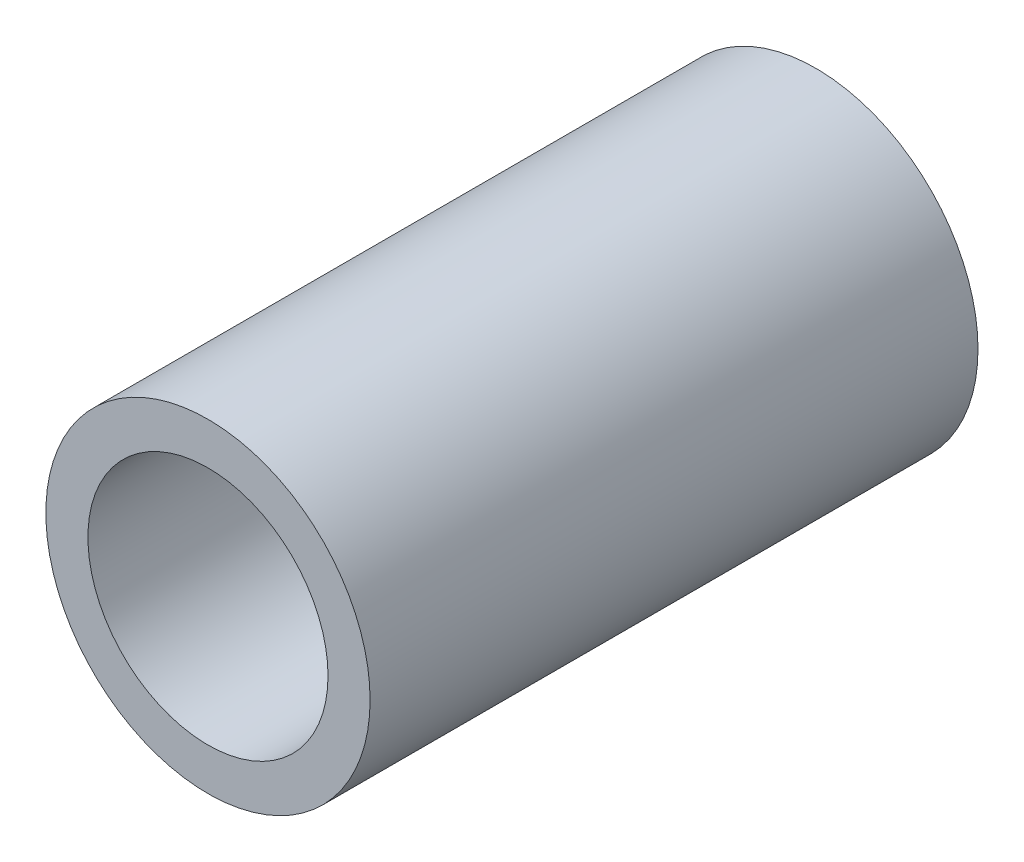
ISO-10303-21;
HEADER;
FILE_DESCRIPTION(('STEP AP214'),'2;1');
FILE_NAME('part.step','',(''),(''),'','','');
FILE_SCHEMA(('AUTOMOTIVE_DESIGN { 1 0 10303 214 1 1 1 1 }'));
ENDSEC;
DATA;
#1=APPLICATION_CONTEXT('core data for automotive mechanical design processes');
#2=APPLICATION_PROTOCOL_DEFINITION('international standard','automotive_design',2000,#1);
#3=PRODUCT_CONTEXT('',#1,'mechanical');
#4=PRODUCT('Part','Part','',(#3));
#5=PRODUCT_RELATED_PRODUCT_CATEGORY('part','',(#4));
#6=PRODUCT_DEFINITION_FORMATION('','',#4);
#7=PRODUCT_DEFINITION_CONTEXT('part definition',#1,'design');
#8=PRODUCT_DEFINITION('design','',#6,#7);
#9=PRODUCT_DEFINITION_SHAPE('','',#8);
#10=(LENGTH_UNIT() NAMED_UNIT(*) SI_UNIT(.MILLI.,.METRE.));
#11=(NAMED_UNIT(*) PLANE_ANGLE_UNIT() SI_UNIT($,.RADIAN.));
#12=(NAMED_UNIT(*) SI_UNIT($,.STERADIAN.) SOLID_ANGLE_UNIT());
#13=UNCERTAINTY_MEASURE_WITH_UNIT(LENGTH_MEASURE(1.E-05),#10,'distance_accuracy_value','');
#14=(GEOMETRIC_REPRESENTATION_CONTEXT(3) GLOBAL_UNCERTAINTY_ASSIGNED_CONTEXT((#13)) GLOBAL_UNIT_ASSIGNED_CONTEXT((#10,
#11,#12)) REPRESENTATION_CONTEXT('',''));
#15=CARTESIAN_POINT('',(0.,0.,0.));
#16=DIRECTION('',(0.,0.,1.));
#17=DIRECTION('',(1.,0.,0.));
#18=AXIS2_PLACEMENT_3D('',#15,#16,#17);
#19=CARTESIAN_POINT('',(0.,0.,20.));
#20=DIRECTION('',(0.,0.,1.));
#21=DIRECTION('',(1.,0.,0.));
#22=AXIS2_PLACEMENT_3D('',#19,#20,#21);
#23=PLANE('',#22);
#24=CARTESIAN_POINT('',(0.,0.,20.));
#25=DIRECTION('',(0.,0.,1.));
#26=DIRECTION('',(1.,0.,0.));
#27=AXIS2_PLACEMENT_3D('',#24,#25,#26);
#28=CIRCLE('',#27,10.668);
#29=CARTESIAN_POINT('',(10.668,0.,20.));
#30=VERTEX_POINT('',#29);
#31=EDGE_CURVE('E11',#30,#30,#28,.T.);
#32=ORIENTED_EDGE('',*,*,#31,.T.);
#33=EDGE_LOOP('',(#32));
#34=FACE_BOUND('',#33,.T.);
#35=CARTESIAN_POINT('',(0.,0.,20.));
#36=DIRECTION('',(0.,0.,1.));
#37=DIRECTION('',(1.,0.,0.));
#38=AXIS2_PLACEMENT_3D('',#35,#36,#37);
#39=CIRCLE('',#38,7.8994);
#40=CARTESIAN_POINT('',(7.8994,0.,20.));
#41=VERTEX_POINT('',#40);
#42=EDGE_CURVE('E48',#41,#41,#39,.T.);
#43=ORIENTED_EDGE('',*,*,#42,.F.);
#44=EDGE_LOOP('',(#43));
#45=FACE_BOUND('',#44,.T.);
#46=ADVANCED_FACE('F37',(#34,#45),#23,.T.);
#47=CARTESIAN_POINT('',(0.,0.,-20.));
#48=DIRECTION('',(0.,0.,1.));
#49=DIRECTION('',(1.,0.,0.));
#50=AXIS2_PLACEMENT_3D('',#47,#48,#49);
#51=PLANE('',#50);
#52=CARTESIAN_POINT('',(0.,0.,-20.));
#53=DIRECTION('',(0.,0.,1.));
#54=DIRECTION('',(1.,0.,0.));
#55=AXIS2_PLACEMENT_3D('',#52,#53,#54);
#56=CIRCLE('',#55,10.668);
#57=CARTESIAN_POINT('',(10.668,0.,-20.));
#58=VERTEX_POINT('',#57);
#59=EDGE_CURVE('E41',#58,#58,#56,.T.);
#60=ORIENTED_EDGE('',*,*,#59,.F.);
#61=EDGE_LOOP('',(#60));
#62=FACE_BOUND('',#61,.T.);
#63=CARTESIAN_POINT('',(0.,0.,-20.));
#64=DIRECTION('',(0.,0.,1.));
#65=DIRECTION('',(1.,0.,0.));
#66=AXIS2_PLACEMENT_3D('',#63,#64,#65);
#67=CIRCLE('',#66,7.8994);
#68=CARTESIAN_POINT('',(7.8994,0.,-20.));
#69=VERTEX_POINT('',#68);
#70=EDGE_CURVE('E50',#69,#69,#67,.T.);
#71=ORIENTED_EDGE('',*,*,#70,.T.);
#72=EDGE_LOOP('',(#71));
#73=FACE_BOUND('',#72,.T.);
#74=ADVANCED_FACE('F60',(#62,#73),#51,.F.);
#75=CARTESIAN_POINT('',(0.,0.,20.));
#76=DIRECTION('',(0.,0.,-1.));
#77=DIRECTION('',(-1.,0.,0.));
#78=AXIS2_PLACEMENT_3D('',#75,#76,#77);
#79=CYLINDRICAL_SURFACE('',#78,10.668);
#80=ORIENTED_EDGE('',*,*,#31,.F.);
#81=EDGE_LOOP('',(#80));
#82=FACE_BOUND('',#81,.T.);
#83=ORIENTED_EDGE('',*,*,#59,.T.);
#84=EDGE_LOOP('',(#83));
#85=FACE_BOUND('',#84,.T.);
#86=ADVANCED_FACE('F39',(#82,#85),#79,.T.);
#87=CARTESIAN_POINT('',(0.,0.,20.));
#88=DIRECTION('',(0.,0.,-1.));
#89=DIRECTION('',(-1.,0.,0.));
#90=AXIS2_PLACEMENT_3D('',#87,#88,#89);
#91=CYLINDRICAL_SURFACE('',#90,7.8994);
#92=ORIENTED_EDGE('',*,*,#42,.T.);
#93=EDGE_LOOP('',(#92));
#94=FACE_BOUND('',#93,.T.);
#95=ORIENTED_EDGE('',*,*,#70,.F.);
#96=EDGE_LOOP('',(#95));
#97=FACE_BOUND('',#96,.T.);
#98=ADVANCED_FACE('F56',(#94,#97),#91,.F.);
#99=CLOSED_SHELL('',(#46,#74,#86,#98));
#100=MANIFOLD_SOLID_BREP('B2',#99);
#101=ADVANCED_BREP_SHAPE_REPRESENTATION('',(#18,#100),#14);
#102=SHAPE_DEFINITION_REPRESENTATION(#9,#101);
ENDSEC;
END-ISO-10303-21;
